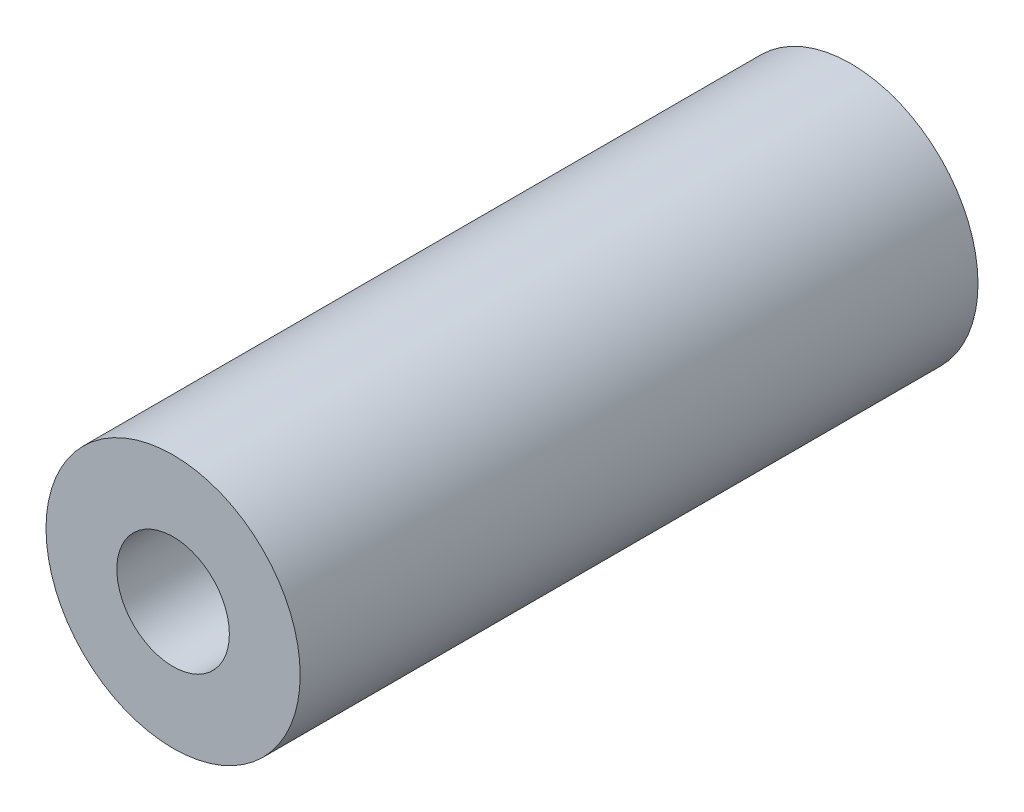
ISO-10303-21;
HEADER;
FILE_DESCRIPTION(('STEP AP214'),'2;1');
FILE_NAME('part.step','',(''),(''),'','','');
FILE_SCHEMA(('AUTOMOTIVE_DESIGN { 1 0 10303 214 1 1 1 1 }'));
ENDSEC;
DATA;
#1=APPLICATION_CONTEXT('core data for automotive mechanical design processes');
#2=APPLICATION_PROTOCOL_DEFINITION('international standard','automotive_design',2000,#1);
#3=PRODUCT_CONTEXT('',#1,'mechanical');
#4=PRODUCT('Part','Part','',(#3));
#5=PRODUCT_RELATED_PRODUCT_CATEGORY('part','',(#4));
#6=PRODUCT_DEFINITION_FORMATION('','',#4);
#7=PRODUCT_DEFINITION_CONTEXT('part definition',#1,'design');
#8=PRODUCT_DEFINITION('design','',#6,#7);
#9=PRODUCT_DEFINITION_SHAPE('','',#8);
#10=(LENGTH_UNIT() NAMED_UNIT(*) SI_UNIT(.MILLI.,.METRE.));
#11=(NAMED_UNIT(*) PLANE_ANGLE_UNIT() SI_UNIT($,.RADIAN.));
#12=(NAMED_UNIT(*) SI_UNIT($,.STERADIAN.) SOLID_ANGLE_UNIT());
#13=UNCERTAINTY_MEASURE_WITH_UNIT(LENGTH_MEASURE(1.E-05),#10,'distance_accuracy_value','');
#14=(GEOMETRIC_REPRESENTATION_CONTEXT(3) GLOBAL_UNCERTAINTY_ASSIGNED_CONTEXT((#13)) GLOBAL_UNIT_ASSIGNED_CONTEXT((#10,
#11,#12)) REPRESENTATION_CONTEXT('',''));
#15=CARTESIAN_POINT('',(0.,0.,0.));
#16=DIRECTION('',(0.,0.,1.));
#17=DIRECTION('',(1.,0.,0.));
#18=AXIS2_PLACEMENT_3D('',#15,#16,#17);
#19=CARTESIAN_POINT('',(0.,0.,12.7));
#20=DIRECTION('',(0.,0.,1.));
#21=DIRECTION('',(1.,0.,0.));
#22=AXIS2_PLACEMENT_3D('',#19,#20,#21);
#23=PLANE('',#22);
#24=CARTESIAN_POINT('',(0.,0.,12.7));
#25=DIRECTION('',(0.,0.,1.));
#26=DIRECTION('',(1.,0.,0.));
#27=AXIS2_PLACEMENT_3D('',#24,#25,#26);
#28=CIRCLE('',#27,4.7625);
#29=CARTESIAN_POINT('',(4.7625,0.,12.7));
#30=VERTEX_POINT('',#29);
#31=EDGE_CURVE('E10',#30,#30,#28,.T.);
#32=ORIENTED_EDGE('',*,*,#31,.T.);
#33=EDGE_LOOP('',(#32));
#34=FACE_BOUND('',#33,.T.);
#35=CARTESIAN_POINT('',(0.,0.,12.7));
#36=DIRECTION('',(0.,0.,1.));
#37=DIRECTION('',(1.,0.,0.));
#38=AXIS2_PLACEMENT_3D('',#35,#36,#37);
#39=CIRCLE('',#38,2.1082);
#40=CARTESIAN_POINT('',(2.1082,0.,12.7));
#41=VERTEX_POINT('',#40);
#42=EDGE_CURVE('E37',#41,#41,#39,.T.);
#43=ORIENTED_EDGE('',*,*,#42,.F.);
#44=EDGE_LOOP('',(#43));
#45=FACE_BOUND('',#44,.T.);
#46=ADVANCED_FACE('F30',(#34,#45),#23,.T.);
#47=CARTESIAN_POINT('',(0.,0.,12.7));
#48=DIRECTION('',(0.,0.,-1.));
#49=DIRECTION('',(-1.,0.,0.));
#50=AXIS2_PLACEMENT_3D('',#47,#48,#49);
#51=CYLINDRICAL_SURFACE('',#50,4.7625);
#52=ORIENTED_EDGE('',*,*,#31,.F.);
#53=EDGE_LOOP('',(#52));
#54=FACE_BOUND('',#53,.T.);
#55=CARTESIAN_POINT('',(0.,0.,-12.7));
#56=DIRECTION('',(0.,0.,1.));
#57=DIRECTION('',(1.,0.,0.));
#58=AXIS2_PLACEMENT_3D('',#55,#56,#57);
#59=CIRCLE('',#58,4.7625);
#60=CARTESIAN_POINT('',(4.7625,0.,-12.7));
#61=VERTEX_POINT('',#60);
#62=EDGE_CURVE('E41',#61,#61,#59,.T.);
#63=ORIENTED_EDGE('',*,*,#62,.T.);
#64=EDGE_LOOP('',(#63));
#65=FACE_BOUND('',#64,.T.);
#66=ADVANCED_FACE('F32',(#54,#65),#51,.T.);
#67=CARTESIAN_POINT('',(0.,0.,12.7));
#68=DIRECTION('',(0.,0.,-1.));
#69=DIRECTION('',(-1.,0.,0.));
#70=AXIS2_PLACEMENT_3D('',#67,#68,#69);
#71=CYLINDRICAL_SURFACE('',#70,2.1082);
#72=ORIENTED_EDGE('',*,*,#42,.T.);
#73=EDGE_LOOP('',(#72));
#74=FACE_BOUND('',#73,.T.);
#75=CARTESIAN_POINT('',(0.,0.,-12.7));
#76=DIRECTION('',(0.,0.,1.));
#77=DIRECTION('',(1.,0.,0.));
#78=AXIS2_PLACEMENT_3D('',#75,#76,#77);
#79=CIRCLE('',#78,2.1082);
#80=CARTESIAN_POINT('',(2.1082,0.,-12.7));
#81=VERTEX_POINT('',#80);
#82=EDGE_CURVE('E45',#81,#81,#79,.T.);
#83=ORIENTED_EDGE('',*,*,#82,.F.);
#84=EDGE_LOOP('',(#83));
#85=FACE_BOUND('',#84,.T.);
#86=ADVANCED_FACE('F54',(#74,#85),#71,.F.);
#87=CARTESIAN_POINT('',(0.,0.,-12.7));
#88=DIRECTION('',(0.,0.,1.));
#89=DIRECTION('',(1.,0.,0.));
#90=AXIS2_PLACEMENT_3D('',#87,#88,#89);
#91=PLANE('',#90);
#92=ORIENTED_EDGE('',*,*,#82,.T.);
#93=EDGE_LOOP('',(#92));
#94=FACE_BOUND('',#93,.T.);
#95=ORIENTED_EDGE('',*,*,#62,.F.);
#96=EDGE_LOOP('',(#95));
#97=FACE_BOUND('',#96,.T.);
#98=ADVANCED_FACE('F51',(#94,#97),#91,.F.);
#99=CLOSED_SHELL('',(#46,#66,#86,#98));
#100=MANIFOLD_SOLID_BREP('B2',#99);
#101=ADVANCED_BREP_SHAPE_REPRESENTATION('',(#18,#100),#14);
#102=SHAPE_DEFINITION_REPRESENTATION(#9,#101);
ENDSEC;
END-ISO-10303-21;
